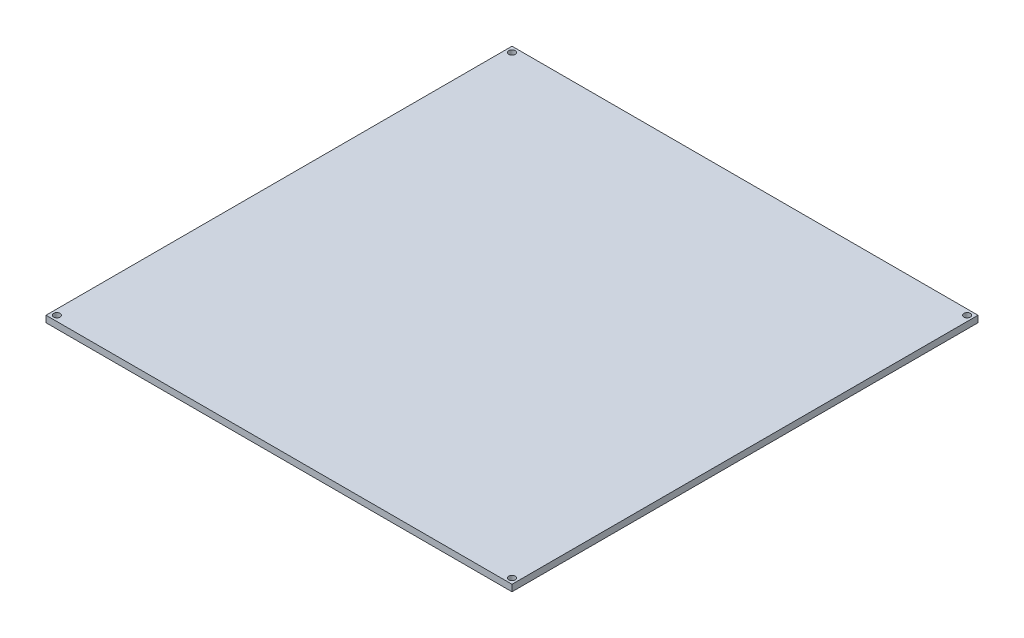
ISO-10303-21;
HEADER;
FILE_DESCRIPTION(('STEP AP214'),'2;1');
FILE_NAME('part.step','',(''),(''),'','','');
FILE_SCHEMA(('AUTOMOTIVE_DESIGN { 1 0 10303 214 1 1 1 1 }'));
ENDSEC;
DATA;
#1=APPLICATION_CONTEXT('core data for automotive mechanical design processes');
#2=APPLICATION_PROTOCOL_DEFINITION('international standard','automotive_design',2000,#1);
#3=PRODUCT_CONTEXT('',#1,'mechanical');
#4=PRODUCT('Part','Part','',(#3));
#5=PRODUCT_RELATED_PRODUCT_CATEGORY('part','',(#4));
#6=PRODUCT_DEFINITION_FORMATION('','',#4);
#7=PRODUCT_DEFINITION_CONTEXT('part definition',#1,'design');
#8=PRODUCT_DEFINITION('design','',#6,#7);
#9=PRODUCT_DEFINITION_SHAPE('','',#8);
#10=(LENGTH_UNIT() NAMED_UNIT(*) SI_UNIT(.MILLI.,.METRE.));
#11=(NAMED_UNIT(*) PLANE_ANGLE_UNIT() SI_UNIT($,.RADIAN.));
#12=(NAMED_UNIT(*) SI_UNIT($,.STERADIAN.) SOLID_ANGLE_UNIT());
#13=UNCERTAINTY_MEASURE_WITH_UNIT(LENGTH_MEASURE(1.E-05),#10,'distance_accuracy_value','');
#14=(GEOMETRIC_REPRESENTATION_CONTEXT(3) GLOBAL_UNCERTAINTY_ASSIGNED_CONTEXT((#13)) GLOBAL_UNIT_ASSIGNED_CONTEXT((#10,
#11,#12)) REPRESENTATION_CONTEXT('',''));
#15=CARTESIAN_POINT('',(0.,0.,0.));
#16=DIRECTION('',(0.,0.,1.));
#17=DIRECTION('',(1.,0.,0.));
#18=AXIS2_PLACEMENT_3D('',#15,#16,#17);
#19=CARTESIAN_POINT('',(-107.,-3.,107.));
#20=DIRECTION('',(0.,0.,1.));
#21=DIRECTION('',(1.,0.,0.));
#22=AXIS2_PLACEMENT_3D('',#19,#20,#21);
#23=PLANE('',#22);
#24=DIRECTION('',(1.,0.,0.));
#25=VECTOR('',#24,1.);
#26=CARTESIAN_POINT('',(-107.,0.,107.));
#27=LINE('',#26,#25);
#28=CARTESIAN_POINT('',(-107.,0.,107.));
#29=VERTEX_POINT('',#28);
#30=CARTESIAN_POINT('',(107.,0.,107.));
#31=VERTEX_POINT('',#30);
#32=EDGE_CURVE('E105',#29,#31,#27,.T.);
#33=ORIENTED_EDGE('',*,*,#32,.F.);
#34=DIRECTION('',(0.,1.,0.));
#35=VECTOR('',#34,1.);
#36=CARTESIAN_POINT('',(-107.,-3.,107.));
#37=LINE('',#36,#35);
#38=CARTESIAN_POINT('',(-107.,-3.,107.));
#39=VERTEX_POINT('',#38);
#40=EDGE_CURVE('E11',#39,#29,#37,.T.);
#41=ORIENTED_EDGE('',*,*,#40,.F.);
#42=DIRECTION('',(1.,0.,0.));
#43=VECTOR('',#42,1.);
#44=CARTESIAN_POINT('',(-107.,-3.,107.));
#45=LINE('',#44,#43);
#46=CARTESIAN_POINT('',(107.,-3.,107.));
#47=VERTEX_POINT('',#46);
#48=EDGE_CURVE('E95',#39,#47,#45,.T.);
#49=ORIENTED_EDGE('',*,*,#48,.T.);
#50=DIRECTION('',(0.,1.,0.));
#51=VECTOR('',#50,1.);
#52=CARTESIAN_POINT('',(107.,-3.,107.));
#53=LINE('',#52,#51);
#54=EDGE_CURVE('E39',#47,#31,#53,.T.);
#55=ORIENTED_EDGE('',*,*,#54,.T.);
#56=EDGE_LOOP('',(#33,#41,#49,#55));
#57=FACE_BOUND('',#56,.T.);
#58=ADVANCED_FACE('F36',(#57),#23,.T.);
#59=CARTESIAN_POINT('',(-107.,-3.,-107.));
#60=DIRECTION('',(-1.,0.,0.));
#61=DIRECTION('',(0.,0.,1.));
#62=AXIS2_PLACEMENT_3D('',#59,#60,#61);
#63=PLANE('',#62);
#64=DIRECTION('',(0.,0.,1.));
#65=VECTOR('',#64,1.);
#66=CARTESIAN_POINT('',(-107.,0.,-107.));
#67=LINE('',#66,#65);
#68=CARTESIAN_POINT('',(-107.,0.,-107.));
#69=VERTEX_POINT('',#68);
#70=EDGE_CURVE('E100',#69,#29,#67,.T.);
#71=ORIENTED_EDGE('',*,*,#70,.F.);
#72=DIRECTION('',(0.,1.,0.));
#73=VECTOR('',#72,1.);
#74=CARTESIAN_POINT('',(-107.,-3.,-107.));
#75=LINE('',#74,#73);
#76=CARTESIAN_POINT('',(-107.,-3.,-107.));
#77=VERTEX_POINT('',#76);
#78=EDGE_CURVE('E45',#77,#69,#75,.T.);
#79=ORIENTED_EDGE('',*,*,#78,.F.);
#80=DIRECTION('',(0.,0.,1.));
#81=VECTOR('',#80,1.);
#82=CARTESIAN_POINT('',(-107.,-3.,-107.));
#83=LINE('',#82,#81);
#84=EDGE_CURVE('E91',#77,#39,#83,.T.);
#85=ORIENTED_EDGE('',*,*,#84,.T.);
#86=ORIENTED_EDGE('',*,*,#40,.T.);
#87=EDGE_LOOP('',(#71,#79,#85,#86));
#88=FACE_BOUND('',#87,.T.);
#89=ADVANCED_FACE('F116',(#88),#63,.T.);
#90=CARTESIAN_POINT('',(107.,-3.,-107.));
#91=DIRECTION('',(0.,0.,-1.));
#92=DIRECTION('',(-1.,0.,0.));
#93=AXIS2_PLACEMENT_3D('',#90,#91,#92);
#94=PLANE('',#93);
#95=DIRECTION('',(-1.,0.,0.));
#96=VECTOR('',#95,1.);
#97=CARTESIAN_POINT('',(107.,0.,-107.));
#98=LINE('',#97,#96);
#99=CARTESIAN_POINT('',(107.,0.,-107.));
#100=VERTEX_POINT('',#99);
#101=EDGE_CURVE('E86',#100,#69,#98,.T.);
#102=ORIENTED_EDGE('',*,*,#101,.F.);
#103=DIRECTION('',(0.,1.,0.));
#104=VECTOR('',#103,1.);
#105=CARTESIAN_POINT('',(107.,-3.,-107.));
#106=LINE('',#105,#104);
#107=CARTESIAN_POINT('',(107.,-3.,-107.));
#108=VERTEX_POINT('',#107);
#109=EDGE_CURVE('E81',#108,#100,#106,.T.);
#110=ORIENTED_EDGE('',*,*,#109,.F.);
#111=DIRECTION('',(-1.,0.,0.));
#112=VECTOR('',#111,1.);
#113=CARTESIAN_POINT('',(107.,-3.,-107.));
#114=LINE('',#113,#112);
#115=EDGE_CURVE('E84',#108,#77,#114,.T.);
#116=ORIENTED_EDGE('',*,*,#115,.T.);
#117=ORIENTED_EDGE('',*,*,#78,.T.);
#118=EDGE_LOOP('',(#102,#110,#116,#117));
#119=FACE_BOUND('',#118,.T.);
#120=ADVANCED_FACE('F83',(#119),#94,.T.);
#121=CARTESIAN_POINT('',(107.,-3.,107.));
#122=DIRECTION('',(1.,0.,0.));
#123=DIRECTION('',(0.,0.,-1.));
#124=AXIS2_PLACEMENT_3D('',#121,#122,#123);
#125=PLANE('',#124);
#126=DIRECTION('',(0.,0.,-1.));
#127=VECTOR('',#126,1.);
#128=CARTESIAN_POINT('',(107.,0.,107.));
#129=LINE('',#128,#127);
#130=EDGE_CURVE('E108',#31,#100,#129,.T.);
#131=ORIENTED_EDGE('',*,*,#130,.F.);
#132=ORIENTED_EDGE('',*,*,#54,.F.);
#133=DIRECTION('',(0.,0.,-1.));
#134=VECTOR('',#133,1.);
#135=CARTESIAN_POINT('',(107.,-3.,107.));
#136=LINE('',#135,#134);
#137=EDGE_CURVE('E90',#47,#108,#136,.T.);
#138=ORIENTED_EDGE('',*,*,#137,.T.);
#139=ORIENTED_EDGE('',*,*,#109,.T.);
#140=EDGE_LOOP('',(#131,#132,#138,#139));
#141=FACE_BOUND('',#140,.T.);
#142=ADVANCED_FACE('F93',(#141),#125,.T.);
#143=CARTESIAN_POINT('',(0.,-3.,0.));
#144=DIRECTION('',(0.,1.,0.));
#145=DIRECTION('',(0.,0.,1.));
#146=AXIS2_PLACEMENT_3D('',#143,#144,#145);
#147=PLANE('',#146);
#148=CARTESIAN_POINT('',(-104.5,-3.,-104.5));
#149=DIRECTION('',(0.,1.,0.));
#150=DIRECTION('',(0.,0.,-1.));
#151=AXIS2_PLACEMENT_3D('',#148,#149,#150);
#152=CIRCLE('',#151,1.5);
#153=CARTESIAN_POINT('',(-104.5,-3.,-106.));
#154=VERTEX_POINT('',#153);
#155=EDGE_CURVE('E156',#154,#154,#152,.T.);
#156=ORIENTED_EDGE('',*,*,#155,.T.);
#157=EDGE_LOOP('',(#156));
#158=FACE_BOUND('',#157,.T.);
#159=CARTESIAN_POINT('',(104.5,-3.,104.5));
#160=DIRECTION('',(0.,1.,0.));
#161=DIRECTION('',(0.,0.,-1.));
#162=AXIS2_PLACEMENT_3D('',#159,#160,#161);
#163=CIRCLE('',#162,1.5);
#164=CARTESIAN_POINT('',(104.5,-3.,103.));
#165=VERTEX_POINT('',#164);
#166=EDGE_CURVE('E164',#165,#165,#163,.T.);
#167=ORIENTED_EDGE('',*,*,#166,.T.);
#168=EDGE_LOOP('',(#167));
#169=FACE_BOUND('',#168,.T.);
#170=CARTESIAN_POINT('',(-104.5,-3.,104.5));
#171=DIRECTION('',(0.,1.,0.));
#172=DIRECTION('',(0.,0.,-1.));
#173=AXIS2_PLACEMENT_3D('',#170,#171,#172);
#174=CIRCLE('',#173,1.5);
#175=CARTESIAN_POINT('',(-104.5,-3.,103.));
#176=VERTEX_POINT('',#175);
#177=EDGE_CURVE('E170',#176,#176,#174,.T.);
#178=ORIENTED_EDGE('',*,*,#177,.T.);
#179=EDGE_LOOP('',(#178));
#180=FACE_BOUND('',#179,.T.);
#181=CARTESIAN_POINT('',(104.5,-3.,-104.5));
#182=DIRECTION('',(0.,1.,0.));
#183=DIRECTION('',(0.,0.,-1.));
#184=AXIS2_PLACEMENT_3D('',#181,#182,#183);
#185=CIRCLE('',#184,1.5);
#186=CARTESIAN_POINT('',(104.5,-3.,-106.));
#187=VERTEX_POINT('',#186);
#188=EDGE_CURVE('E109',#187,#187,#185,.T.);
#189=ORIENTED_EDGE('',*,*,#188,.T.);
#190=EDGE_LOOP('',(#189));
#191=FACE_BOUND('',#190,.T.);
#192=ORIENTED_EDGE('',*,*,#48,.F.);
#193=ORIENTED_EDGE('',*,*,#84,.F.);
#194=ORIENTED_EDGE('',*,*,#115,.F.);
#195=ORIENTED_EDGE('',*,*,#137,.F.);
#196=EDGE_LOOP('',(#192,#193,#194,#195));
#197=FACE_BOUND('',#196,.T.);
#198=ADVANCED_FACE('F89',(#158,#169,#180,#191,#197),#147,.F.);
#199=CARTESIAN_POINT('',(0.,0.,0.));
#200=DIRECTION('',(0.,1.,0.));
#201=DIRECTION('',(0.,0.,1.));
#202=AXIS2_PLACEMENT_3D('',#199,#200,#201);
#203=PLANE('',#202);
#204=CARTESIAN_POINT('',(-104.5,0.,-104.5));
#205=DIRECTION('',(0.,1.,0.));
#206=DIRECTION('',(0.,0.,-1.));
#207=AXIS2_PLACEMENT_3D('',#204,#205,#206);
#208=CIRCLE('',#207,1.5);
#209=CARTESIAN_POINT('',(-104.5,0.,-106.));
#210=VERTEX_POINT('',#209);
#211=EDGE_CURVE('E159',#210,#210,#208,.T.);
#212=ORIENTED_EDGE('',*,*,#211,.F.);
#213=EDGE_LOOP('',(#212));
#214=FACE_BOUND('',#213,.T.);
#215=CARTESIAN_POINT('',(104.5,0.,104.5));
#216=DIRECTION('',(0.,1.,0.));
#217=DIRECTION('',(0.,0.,-1.));
#218=AXIS2_PLACEMENT_3D('',#215,#216,#217);
#219=CIRCLE('',#218,1.5);
#220=CARTESIAN_POINT('',(104.5,0.,103.));
#221=VERTEX_POINT('',#220);
#222=EDGE_CURVE('E161',#221,#221,#219,.T.);
#223=ORIENTED_EDGE('',*,*,#222,.F.);
#224=EDGE_LOOP('',(#223));
#225=FACE_BOUND('',#224,.T.);
#226=CARTESIAN_POINT('',(-104.5,0.,104.5));
#227=DIRECTION('',(0.,1.,0.));
#228=DIRECTION('',(0.,0.,-1.));
#229=AXIS2_PLACEMENT_3D('',#226,#227,#228);
#230=CIRCLE('',#229,1.5);
#231=CARTESIAN_POINT('',(-104.5,0.,103.));
#232=VERTEX_POINT('',#231);
#233=EDGE_CURVE('E167',#232,#232,#230,.T.);
#234=ORIENTED_EDGE('',*,*,#233,.F.);
#235=EDGE_LOOP('',(#234));
#236=FACE_BOUND('',#235,.T.);
#237=CARTESIAN_POINT('',(104.5,0.,-104.5));
#238=DIRECTION('',(0.,1.,0.));
#239=DIRECTION('',(0.,0.,-1.));
#240=AXIS2_PLACEMENT_3D('',#237,#238,#239);
#241=CIRCLE('',#240,1.5);
#242=CARTESIAN_POINT('',(104.5,0.,-106.));
#243=VERTEX_POINT('',#242);
#244=EDGE_CURVE('E173',#243,#243,#241,.T.);
#245=ORIENTED_EDGE('',*,*,#244,.F.);
#246=EDGE_LOOP('',(#245));
#247=FACE_BOUND('',#246,.T.);
#248=ORIENTED_EDGE('',*,*,#32,.T.);
#249=ORIENTED_EDGE('',*,*,#130,.T.);
#250=ORIENTED_EDGE('',*,*,#101,.T.);
#251=ORIENTED_EDGE('',*,*,#70,.T.);
#252=EDGE_LOOP('',(#248,#249,#250,#251));
#253=FACE_BOUND('',#252,.T.);
#254=ADVANCED_FACE('F115',(#214,#225,#236,#247,#253),#203,.T.);
#255=CARTESIAN_POINT('',(104.5,-3.,-104.5));
#256=DIRECTION('',(0.,1.,0.));
#257=DIRECTION('',(0.,0.,1.));
#258=AXIS2_PLACEMENT_3D('',#255,#256,#257);
#259=CYLINDRICAL_SURFACE('',#258,1.5);
#260=ORIENTED_EDGE('',*,*,#188,.F.);
#261=EDGE_LOOP('',(#260));
#262=FACE_BOUND('',#261,.T.);
#263=ORIENTED_EDGE('',*,*,#244,.T.);
#264=EDGE_LOOP('',(#263));
#265=FACE_BOUND('',#264,.T.);
#266=ADVANCED_FACE('F133',(#262,#265),#259,.F.);
#267=CARTESIAN_POINT('',(-104.5,-3.,104.5));
#268=DIRECTION('',(0.,1.,0.));
#269=DIRECTION('',(0.,0.,1.));
#270=AXIS2_PLACEMENT_3D('',#267,#268,#269);
#271=CYLINDRICAL_SURFACE('',#270,1.5);
#272=ORIENTED_EDGE('',*,*,#177,.F.);
#273=EDGE_LOOP('',(#272));
#274=FACE_BOUND('',#273,.T.);
#275=ORIENTED_EDGE('',*,*,#233,.T.);
#276=EDGE_LOOP('',(#275));
#277=FACE_BOUND('',#276,.T.);
#278=ADVANCED_FACE('F140',(#274,#277),#271,.F.);
#279=CARTESIAN_POINT('',(104.5,-3.,104.5));
#280=DIRECTION('',(0.,1.,0.));
#281=DIRECTION('',(0.,0.,1.));
#282=AXIS2_PLACEMENT_3D('',#279,#280,#281);
#283=CYLINDRICAL_SURFACE('',#282,1.5);
#284=ORIENTED_EDGE('',*,*,#166,.F.);
#285=EDGE_LOOP('',(#284));
#286=FACE_BOUND('',#285,.T.);
#287=ORIENTED_EDGE('',*,*,#222,.T.);
#288=EDGE_LOOP('',(#287));
#289=FACE_BOUND('',#288,.T.);
#290=ADVANCED_FACE('F144',(#286,#289),#283,.F.);
#291=CARTESIAN_POINT('',(-104.5,-3.,-104.5));
#292=DIRECTION('',(0.,1.,0.));
#293=DIRECTION('',(0.,0.,1.));
#294=AXIS2_PLACEMENT_3D('',#291,#292,#293);
#295=CYLINDRICAL_SURFACE('',#294,1.5);
#296=ORIENTED_EDGE('',*,*,#155,.F.);
#297=EDGE_LOOP('',(#296));
#298=FACE_BOUND('',#297,.T.);
#299=ORIENTED_EDGE('',*,*,#211,.T.);
#300=EDGE_LOOP('',(#299));
#301=FACE_BOUND('',#300,.T.);
#302=ADVANCED_FACE('F148',(#298,#301),#295,.F.);
#303=CLOSED_SHELL('',(#58,#89,#120,#142,#198,#254,#266,#278,#290,#302));
#304=MANIFOLD_SOLID_BREP('B2',#303);
#305=ADVANCED_BREP_SHAPE_REPRESENTATION('',(#18,#304),#14);
#306=SHAPE_DEFINITION_REPRESENTATION(#9,#305);
ENDSEC;
END-ISO-10303-21;
